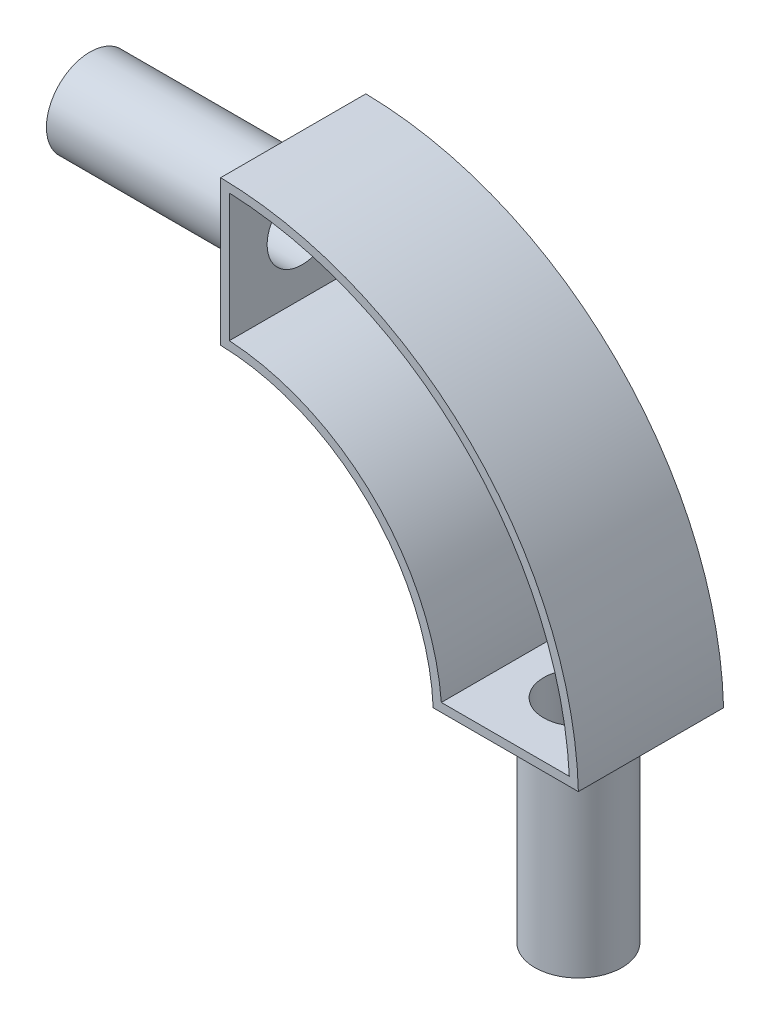
ISO-10303-21;
HEADER;
FILE_DESCRIPTION(('STEP AP214'),'2;1');
FILE_NAME('part.step','',(''),(''),'','','');
FILE_SCHEMA(('AUTOMOTIVE_DESIGN { 1 0 10303 214 1 1 1 1 }'));
ENDSEC;
DATA;
#1=APPLICATION_CONTEXT('core data for automotive mechanical design processes');
#2=APPLICATION_PROTOCOL_DEFINITION('international standard','automotive_design',2000,#1);
#3=PRODUCT_CONTEXT('',#1,'mechanical');
#4=PRODUCT('Part','Part','',(#3));
#5=PRODUCT_RELATED_PRODUCT_CATEGORY('part','',(#4));
#6=PRODUCT_DEFINITION_FORMATION('','',#4);
#7=PRODUCT_DEFINITION_CONTEXT('part definition',#1,'design');
#8=PRODUCT_DEFINITION('design','',#6,#7);
#9=PRODUCT_DEFINITION_SHAPE('','',#8);
#10=(LENGTH_UNIT() NAMED_UNIT(*) SI_UNIT(.MILLI.,.METRE.));
#11=(NAMED_UNIT(*) PLANE_ANGLE_UNIT() SI_UNIT($,.RADIAN.));
#12=(NAMED_UNIT(*) SI_UNIT($,.STERADIAN.) SOLID_ANGLE_UNIT());
#13=UNCERTAINTY_MEASURE_WITH_UNIT(LENGTH_MEASURE(1.E-05),#10,'distance_accuracy_value','');
#14=(GEOMETRIC_REPRESENTATION_CONTEXT(3) GLOBAL_UNCERTAINTY_ASSIGNED_CONTEXT((#13)) GLOBAL_UNIT_ASSIGNED_CONTEXT((#10,
#11,#12)) REPRESENTATION_CONTEXT('',''));
#15=CARTESIAN_POINT('',(0.,0.,0.));
#16=DIRECTION('',(0.,0.,1.));
#17=DIRECTION('',(1.,0.,0.));
#18=AXIS2_PLACEMENT_3D('',#15,#16,#17);
#19=CARTESIAN_POINT('',(-1.75878568718482,-3.47514572884304,25.));
#20=DIRECTION('',(0.,0.,-1.));
#21=DIRECTION('',(-1.,0.,0.));
#22=AXIS2_PLACEMENT_3D('',#19,#20,#21);
#23=PLANE('',#22);
#24=CARTESIAN_POINT('',(-1.75878568718482,-3.47514572884304,25.));
#25=DIRECTION('',(0.,0.,1.));
#26=DIRECTION('',(-1.,0.,0.));
#27=AXIS2_PLACEMENT_3D('',#24,#25,#26);
#28=CIRCLE('',#27,125.);
#29=CARTESIAN_POINT('',(123.192898423768,0.,25.));
#30=VERTEX_POINT('',#29);
#31=CARTESIAN_POINT('',(0.,121.512480350328,25.));
#32=VERTEX_POINT('',#31);
#33=EDGE_CURVE('E142',#30,#32,#28,.T.);
#34=ORIENTED_EDGE('',*,*,#33,.T.);
#35=DIRECTION('',(0.,-1.,0.));
#36=VECTOR('',#35,1.);
#37=CARTESIAN_POINT('',(0.,71.5124803503275,25.));
#38=LINE('',#37,#36);
#39=CARTESIAN_POINT('',(0.,71.5124803503275,25.));
#40=VERTEX_POINT('',#39);
#41=EDGE_CURVE('E86',#32,#40,#38,.T.);
#42=ORIENTED_EDGE('',*,*,#41,.T.);
#43=CARTESIAN_POINT('',(-1.72689536458121,-3.46763589658015,25.));
#44=DIRECTION('',(0.,0.,-1.));
#45=DIRECTION('',(-1.,0.,0.));
#46=AXIS2_PLACEMENT_3D('',#43,#44,#45);
#47=CIRCLE('',#46,75.);
#48=CARTESIAN_POINT('',(73.1928984237679,0.,25.));
#49=VERTEX_POINT('',#48);
#50=EDGE_CURVE('E145',#40,#49,#47,.T.);
#51=ORIENTED_EDGE('',*,*,#50,.T.);
#52=DIRECTION('',(1.,0.,0.));
#53=VECTOR('',#52,1.);
#54=CARTESIAN_POINT('',(73.1928984237679,0.,25.));
#55=LINE('',#54,#53);
#56=EDGE_CURVE('E57',#49,#30,#55,.T.);
#57=ORIENTED_EDGE('',*,*,#56,.T.);
#58=EDGE_LOOP('',(#34,#42,#51,#57));
#59=FACE_BOUND('',#58,.T.);
#60=CARTESIAN_POINT('',(-1.75878568718482,-3.47514572884304,25.));
#61=DIRECTION('',(0.,0.,-1.));
#62=DIRECTION('',(-1.,0.,0.));
#63=AXIS2_PLACEMENT_3D('',#60,#61,#62);
#64=CIRCLE('',#63,122.);
#65=CARTESIAN_POINT('',(120.069259063563,3.,25.));
#66=VERTEX_POINT('',#65);
#67=CARTESIAN_POINT('',(3.00000000000001,118.43200729666,25.));
#68=VERTEX_POINT('',#67);
#69=EDGE_CURVE('E131',#66,#68,#64,.F.);
#70=ORIENTED_EDGE('',*,*,#69,.F.);
#71=DIRECTION('',(1.,0.,0.));
#72=VECTOR('',#71,1.);
#73=CARTESIAN_POINT('',(-1.75878568718482,3.,25.));
#74=LINE('',#73,#72);
#75=CARTESIAN_POINT('',(76.0044991032223,3.,25.));
#76=VERTEX_POINT('',#75);
#77=EDGE_CURVE('E140',#76,#66,#74,.T.);
#78=ORIENTED_EDGE('',*,*,#77,.F.);
#79=CARTESIAN_POINT('',(-1.72689536458121,-3.46763589658015,25.));
#80=DIRECTION('',(0.,0.,-1.));
#81=DIRECTION('',(-1.,0.,0.));
#82=AXIS2_PLACEMENT_3D('',#79,#80,#81);
#83=CIRCLE('',#82,78.);
#84=CARTESIAN_POINT('',(3.,74.3890045409079,25.));
#85=VERTEX_POINT('',#84);
#86=EDGE_CURVE('E138',#85,#76,#83,.T.);
#87=ORIENTED_EDGE('',*,*,#86,.F.);
#88=DIRECTION('',(0.,-1.,0.));
#89=VECTOR('',#88,1.);
#90=CARTESIAN_POINT('',(2.99999999999999,-3.47514572884304,25.));
#91=LINE('',#90,#89);
#92=EDGE_CURVE('E123',#68,#85,#91,.T.);
#93=ORIENTED_EDGE('',*,*,#92,.F.);
#94=EDGE_LOOP('',(#70,#78,#87,#93));
#95=FACE_BOUND('',#94,.T.);
#96=ADVANCED_FACE('F33',(#59,#95),#23,.F.);
#97=CARTESIAN_POINT('',(-1.75878568718482,-3.47514572884304,25.));
#98=DIRECTION('',(0.,0.,-1.));
#99=DIRECTION('',(-1.,0.,0.));
#100=AXIS2_PLACEMENT_3D('',#97,#98,#99);
#101=CYLINDRICAL_SURFACE('',#100,125.);
#102=CARTESIAN_POINT('',(-1.75878568718482,-3.47514572884304,-25.));
#103=DIRECTION('',(0.,0.,1.));
#104=DIRECTION('',(-1.,0.,0.));
#105=AXIS2_PLACEMENT_3D('',#102,#103,#104);
#106=CIRCLE('',#105,125.);
#107=CARTESIAN_POINT('',(123.192898423768,0.,-25.));
#108=VERTEX_POINT('',#107);
#109=CARTESIAN_POINT('',(0.,121.512480350328,-25.));
#110=VERTEX_POINT('',#109);
#111=EDGE_CURVE('E149',#108,#110,#106,.T.);
#112=ORIENTED_EDGE('',*,*,#111,.T.);
#113=DIRECTION('',(0.,0.,-1.));
#114=VECTOR('',#113,1.);
#115=CARTESIAN_POINT('',(0.,121.512480350328,25.));
#116=LINE('',#115,#114);
#117=EDGE_CURVE('E163',#32,#110,#116,.T.);
#118=ORIENTED_EDGE('',*,*,#117,.F.);
#119=ORIENTED_EDGE('',*,*,#33,.F.);
#120=DIRECTION('',(0.,0.,-1.));
#121=VECTOR('',#120,1.);
#122=CARTESIAN_POINT('',(123.192898423768,0.,25.));
#123=LINE('',#122,#121);
#124=EDGE_CURVE('E148',#30,#108,#123,.T.);
#125=ORIENTED_EDGE('',*,*,#124,.T.);
#126=EDGE_LOOP('',(#112,#118,#119,#125));
#127=FACE_BOUND('',#126,.T.);
#128=ADVANCED_FACE('F35',(#127),#101,.T.);
#129=CARTESIAN_POINT('',(0.,71.5124803503275,25.));
#130=DIRECTION('',(1.,0.,0.));
#131=DIRECTION('',(0.,1.,0.));
#132=AXIS2_PLACEMENT_3D('',#129,#130,#131);
#133=PLANE('',#132);
#134=CARTESIAN_POINT('',(0.,96.5124803503275,0.));
#135=DIRECTION('',(1.,0.,0.));
#136=DIRECTION('',(0.,1.,0.));
#137=AXIS2_PLACEMENT_3D('',#134,#135,#136);
#138=CIRCLE('',#137,15.);
#139=CARTESIAN_POINT('',(0.,111.512480350328,0.));
#140=VERTEX_POINT('',#139);
#141=EDGE_CURVE('E41',#140,#140,#138,.F.);
#142=ORIENTED_EDGE('',*,*,#141,.F.);
#143=EDGE_LOOP('',(#142));
#144=FACE_BOUND('',#143,.T.);
#145=DIRECTION('',(0.,-1.,0.));
#146=VECTOR('',#145,1.);
#147=CARTESIAN_POINT('',(0.,71.5124803503275,-25.));
#148=LINE('',#147,#146);
#149=CARTESIAN_POINT('',(0.,71.5124803503275,-25.));
#150=VERTEX_POINT('',#149);
#151=EDGE_CURVE('E152',#110,#150,#148,.T.);
#152=ORIENTED_EDGE('',*,*,#151,.T.);
#153=DIRECTION('',(0.,0.,-1.));
#154=VECTOR('',#153,1.);
#155=CARTESIAN_POINT('',(0.,71.5124803503275,25.));
#156=LINE('',#155,#154);
#157=EDGE_CURVE('E160',#40,#150,#156,.T.);
#158=ORIENTED_EDGE('',*,*,#157,.F.);
#159=ORIENTED_EDGE('',*,*,#41,.F.);
#160=ORIENTED_EDGE('',*,*,#117,.T.);
#161=EDGE_LOOP('',(#152,#158,#159,#160));
#162=FACE_BOUND('',#161,.T.);
#163=ADVANCED_FACE('F169',(#144,#162),#133,.F.);
#164=CARTESIAN_POINT('',(-1.72689536458121,-3.46763589658015,25.));
#165=DIRECTION('',(0.,0.,-1.));
#166=DIRECTION('',(-1.,0.,0.));
#167=AXIS2_PLACEMENT_3D('',#164,#165,#166);
#168=CYLINDRICAL_SURFACE('',#167,75.);
#169=CARTESIAN_POINT('',(-1.72689536458121,-3.46763589658015,-25.));
#170=DIRECTION('',(0.,0.,-1.));
#171=DIRECTION('',(-1.,0.,0.));
#172=AXIS2_PLACEMENT_3D('',#169,#170,#171);
#173=CIRCLE('',#172,75.);
#174=CARTESIAN_POINT('',(73.1928984237679,0.,-25.));
#175=VERTEX_POINT('',#174);
#176=EDGE_CURVE('E154',#150,#175,#173,.T.);
#177=ORIENTED_EDGE('',*,*,#176,.T.);
#178=DIRECTION('',(0.,0.,-1.));
#179=VECTOR('',#178,1.);
#180=CARTESIAN_POINT('',(73.1928984237679,0.,25.));
#181=LINE('',#180,#179);
#182=EDGE_CURVE('E158',#49,#175,#181,.T.);
#183=ORIENTED_EDGE('',*,*,#182,.F.);
#184=ORIENTED_EDGE('',*,*,#50,.F.);
#185=ORIENTED_EDGE('',*,*,#157,.T.);
#186=EDGE_LOOP('',(#177,#183,#184,#185));
#187=FACE_BOUND('',#186,.T.);
#188=ADVANCED_FACE('F171',(#187),#168,.F.);
#189=CARTESIAN_POINT('',(73.1928984237679,0.,25.));
#190=DIRECTION('',(0.,1.,0.));
#191=DIRECTION('',(0.,0.,1.));
#192=AXIS2_PLACEMENT_3D('',#189,#190,#191);
#193=PLANE('',#192);
#194=CARTESIAN_POINT('',(98.1928984237679,0.,0.));
#195=DIRECTION('',(0.,1.,0.));
#196=DIRECTION('',(0.,0.,1.));
#197=AXIS2_PLACEMENT_3D('',#194,#195,#196);
#198=CIRCLE('',#197,15.);
#199=CARTESIAN_POINT('',(98.1928984237679,0.,15.));
#200=VERTEX_POINT('',#199);
#201=EDGE_CURVE('E11',#200,#200,#198,.F.);
#202=ORIENTED_EDGE('',*,*,#201,.F.);
#203=EDGE_LOOP('',(#202));
#204=FACE_BOUND('',#203,.T.);
#205=DIRECTION('',(1.,0.,0.));
#206=VECTOR('',#205,1.);
#207=CARTESIAN_POINT('',(73.1928984237679,0.,-25.));
#208=LINE('',#207,#206);
#209=EDGE_CURVE('E78',#175,#108,#208,.T.);
#210=ORIENTED_EDGE('',*,*,#209,.T.);
#211=ORIENTED_EDGE('',*,*,#124,.F.);
#212=ORIENTED_EDGE('',*,*,#56,.F.);
#213=ORIENTED_EDGE('',*,*,#182,.T.);
#214=EDGE_LOOP('',(#210,#211,#212,#213));
#215=FACE_BOUND('',#214,.T.);
#216=ADVANCED_FACE('F182',(#204,#215),#193,.F.);
#217=CARTESIAN_POINT('',(-1.75878568718482,-3.47514572884304,-25.));
#218=DIRECTION('',(0.,0.,-1.));
#219=DIRECTION('',(-1.,0.,0.));
#220=AXIS2_PLACEMENT_3D('',#217,#218,#219);
#221=PLANE('',#220);
#222=ORIENTED_EDGE('',*,*,#111,.F.);
#223=ORIENTED_EDGE('',*,*,#209,.F.);
#224=ORIENTED_EDGE('',*,*,#176,.F.);
#225=ORIENTED_EDGE('',*,*,#151,.F.);
#226=EDGE_LOOP('',(#222,#223,#224,#225));
#227=FACE_BOUND('',#226,.T.);
#228=ADVANCED_FACE('F179',(#227),#221,.T.);
#229=CARTESIAN_POINT('',(-1.75878568718482,-3.47514572884304,25.));
#230=DIRECTION('',(0.,0.,-1.));
#231=DIRECTION('',(-1.,0.,0.));
#232=AXIS2_PLACEMENT_3D('',#229,#230,#231);
#233=CYLINDRICAL_SURFACE('',#232,122.);
#234=CARTESIAN_POINT('',(-1.75878568718482,-3.47514572884304,-22.));
#235=DIRECTION('',(0.,0.,-1.));
#236=DIRECTION('',(-1.,0.,0.));
#237=AXIS2_PLACEMENT_3D('',#234,#235,#236);
#238=CIRCLE('',#237,122.);
#239=CARTESIAN_POINT('',(120.069259063563,3.,-22.));
#240=VERTEX_POINT('',#239);
#241=CARTESIAN_POINT('',(3.00000000000001,118.43200729666,-22.));
#242=VERTEX_POINT('',#241);
#243=EDGE_CURVE('E114',#240,#242,#238,.F.);
#244=ORIENTED_EDGE('',*,*,#243,.F.);
#245=DIRECTION('',(0.,0.,-1.));
#246=VECTOR('',#245,1.);
#247=CARTESIAN_POINT('',(120.069259063563,3.,25.));
#248=LINE('',#247,#246);
#249=EDGE_CURVE('E134',#66,#240,#248,.T.);
#250=ORIENTED_EDGE('',*,*,#249,.F.);
#251=ORIENTED_EDGE('',*,*,#69,.T.);
#252=DIRECTION('',(0.,0.,-1.));
#253=VECTOR('',#252,1.);
#254=CARTESIAN_POINT('',(3.00000000000001,118.43200729666,25.));
#255=LINE('',#254,#253);
#256=EDGE_CURVE('E126',#68,#242,#255,.T.);
#257=ORIENTED_EDGE('',*,*,#256,.T.);
#258=EDGE_LOOP('',(#244,#250,#251,#257));
#259=FACE_BOUND('',#258,.T.);
#260=ADVANCED_FACE('F190',(#259),#233,.F.);
#261=CARTESIAN_POINT('',(3.,71.5124803503275,25.));
#262=DIRECTION('',(1.,0.,0.));
#263=DIRECTION('',(0.,1.,0.));
#264=AXIS2_PLACEMENT_3D('',#261,#262,#263);
#265=PLANE('',#264);
#266=CARTESIAN_POINT('',(3.00000000000001,96.5124803503275,0.));
#267=DIRECTION('',(1.,0.,0.));
#268=DIRECTION('',(0.,1.,0.));
#269=AXIS2_PLACEMENT_3D('',#266,#267,#268);
#270=CIRCLE('',#269,12.);
#271=CARTESIAN_POINT('',(3.00000000000001,108.512480350328,0.));
#272=VERTEX_POINT('',#271);
#273=EDGE_CURVE('E255',#272,#272,#270,.T.);
#274=ORIENTED_EDGE('',*,*,#273,.F.);
#275=EDGE_LOOP('',(#274));
#276=FACE_BOUND('',#275,.T.);
#277=DIRECTION('',(0.,-1.,0.));
#278=VECTOR('',#277,1.);
#279=CARTESIAN_POINT('',(2.99999999999999,-3.47514572884304,-22.));
#280=LINE('',#279,#278);
#281=CARTESIAN_POINT('',(3.,74.3890045409079,-22.));
#282=VERTEX_POINT('',#281);
#283=EDGE_CURVE('E108',#242,#282,#280,.T.);
#284=ORIENTED_EDGE('',*,*,#283,.F.);
#285=ORIENTED_EDGE('',*,*,#256,.F.);
#286=ORIENTED_EDGE('',*,*,#92,.T.);
#287=DIRECTION('',(0.,0.,-1.));
#288=VECTOR('',#287,1.);
#289=CARTESIAN_POINT('',(3.,74.3890045409079,25.));
#290=LINE('',#289,#288);
#291=EDGE_CURVE('E120',#85,#282,#290,.T.);
#292=ORIENTED_EDGE('',*,*,#291,.T.);
#293=EDGE_LOOP('',(#284,#285,#286,#292));
#294=FACE_BOUND('',#293,.T.);
#295=ADVANCED_FACE('F121',(#276,#294),#265,.T.);
#296=CARTESIAN_POINT('',(-1.72689536458121,-3.46763589658015,25.));
#297=DIRECTION('',(0.,0.,-1.));
#298=DIRECTION('',(-1.,0.,0.));
#299=AXIS2_PLACEMENT_3D('',#296,#297,#298);
#300=CYLINDRICAL_SURFACE('',#299,78.);
#301=CARTESIAN_POINT('',(-1.72689536458121,-3.46763589658015,-22.));
#302=DIRECTION('',(0.,0.,-1.));
#303=DIRECTION('',(-1.,0.,0.));
#304=AXIS2_PLACEMENT_3D('',#301,#302,#303);
#305=CIRCLE('',#304,78.);
#306=CARTESIAN_POINT('',(76.0044991032223,3.,-22.));
#307=VERTEX_POINT('',#306);
#308=EDGE_CURVE('E112',#282,#307,#305,.T.);
#309=ORIENTED_EDGE('',*,*,#308,.F.);
#310=ORIENTED_EDGE('',*,*,#291,.F.);
#311=ORIENTED_EDGE('',*,*,#86,.T.);
#312=DIRECTION('',(0.,0.,-1.));
#313=VECTOR('',#312,1.);
#314=CARTESIAN_POINT('',(76.0044991032223,3.,25.));
#315=LINE('',#314,#313);
#316=EDGE_CURVE('E48',#76,#307,#315,.T.);
#317=ORIENTED_EDGE('',*,*,#316,.T.);
#318=EDGE_LOOP('',(#309,#310,#311,#317));
#319=FACE_BOUND('',#318,.T.);
#320=ADVANCED_FACE('F128',(#319),#300,.T.);
#321=CARTESIAN_POINT('',(73.1928984237679,3.,25.));
#322=DIRECTION('',(0.,1.,0.));
#323=DIRECTION('',(0.,0.,1.));
#324=AXIS2_PLACEMENT_3D('',#321,#322,#323);
#325=PLANE('',#324);
#326=CARTESIAN_POINT('',(98.1928984237679,3.,0.));
#327=DIRECTION('',(0.,1.,0.));
#328=DIRECTION('',(0.,0.,1.));
#329=AXIS2_PLACEMENT_3D('',#326,#327,#328);
#330=CIRCLE('',#329,12.);
#331=CARTESIAN_POINT('',(98.1928984237679,3.,12.));
#332=VERTEX_POINT('',#331);
#333=EDGE_CURVE('E242',#332,#332,#330,.T.);
#334=ORIENTED_EDGE('',*,*,#333,.F.);
#335=EDGE_LOOP('',(#334));
#336=FACE_BOUND('',#335,.T.);
#337=DIRECTION('',(1.,0.,0.));
#338=VECTOR('',#337,1.);
#339=CARTESIAN_POINT('',(-1.75878568718482,3.,-22.));
#340=LINE('',#339,#338);
#341=EDGE_CURVE('E129',#307,#240,#340,.T.);
#342=ORIENTED_EDGE('',*,*,#341,.F.);
#343=ORIENTED_EDGE('',*,*,#316,.F.);
#344=ORIENTED_EDGE('',*,*,#77,.T.);
#345=ORIENTED_EDGE('',*,*,#249,.T.);
#346=EDGE_LOOP('',(#342,#343,#344,#345));
#347=FACE_BOUND('',#346,.T.);
#348=ADVANCED_FACE('F203',(#336,#347),#325,.T.);
#349=CARTESIAN_POINT('',(-1.75878568718482,-3.47514572884304,-22.));
#350=DIRECTION('',(0.,0.,-1.));
#351=DIRECTION('',(-1.,0.,0.));
#352=AXIS2_PLACEMENT_3D('',#349,#350,#351);
#353=PLANE('',#352);
#354=ORIENTED_EDGE('',*,*,#243,.T.);
#355=ORIENTED_EDGE('',*,*,#283,.T.);
#356=ORIENTED_EDGE('',*,*,#308,.T.);
#357=ORIENTED_EDGE('',*,*,#341,.T.);
#358=EDGE_LOOP('',(#354,#355,#356,#357));
#359=FACE_BOUND('',#358,.T.);
#360=ADVANCED_FACE('F110',(#359),#353,.F.);
#361=CARTESIAN_POINT('',(-70.,96.5124803503275,0.));
#362=DIRECTION('',(1.,0.,0.));
#363=DIRECTION('',(0.,1.,0.));
#364=AXIS2_PLACEMENT_3D('',#361,#362,#363);
#365=CYLINDRICAL_SURFACE('',#364,15.);
#366=CARTESIAN_POINT('',(-70.,96.5124803503275,0.));
#367=DIRECTION('',(-1.,0.,0.));
#368=DIRECTION('',(0.,-1.,0.));
#369=AXIS2_PLACEMENT_3D('',#366,#367,#368);
#370=CIRCLE('',#369,15.);
#371=CARTESIAN_POINT('',(-70.,81.5124803503275,0.));
#372=VERTEX_POINT('',#371);
#373=EDGE_CURVE('E258',#372,#372,#370,.T.);
#374=ORIENTED_EDGE('',*,*,#373,.F.);
#375=EDGE_LOOP('',(#374));
#376=FACE_BOUND('',#375,.T.);
#377=ORIENTED_EDGE('',*,*,#141,.T.);
#378=EDGE_LOOP('',(#377));
#379=FACE_BOUND('',#378,.T.);
#380=ADVANCED_FACE('F167',(#376,#379),#365,.T.);
#381=CARTESIAN_POINT('',(-70.,96.5124803503275,0.));
#382=DIRECTION('',(-1.,0.,0.));
#383=DIRECTION('',(0.,-1.,0.));
#384=AXIS2_PLACEMENT_3D('',#381,#382,#383);
#385=PLANE('',#384);
#386=CARTESIAN_POINT('',(-70.,96.5124803503275,0.));
#387=DIRECTION('',(-1.,0.,0.));
#388=DIRECTION('',(0.,-1.,0.));
#389=AXIS2_PLACEMENT_3D('',#386,#387,#388);
#390=CIRCLE('',#389,12.);
#391=CARTESIAN_POINT('',(-70.,84.5124803503276,0.));
#392=VERTEX_POINT('',#391);
#393=EDGE_CURVE('E252',#392,#392,#390,.T.);
#394=ORIENTED_EDGE('',*,*,#393,.F.);
#395=EDGE_LOOP('',(#394));
#396=FACE_BOUND('',#395,.T.);
#397=ORIENTED_EDGE('',*,*,#373,.T.);
#398=EDGE_LOOP('',(#397));
#399=FACE_BOUND('',#398,.T.);
#400=ADVANCED_FACE('F217',(#396,#399),#385,.T.);
#401=CARTESIAN_POINT('',(5.,96.5124803503275,0.));
#402=DIRECTION('',(-1.,0.,0.));
#403=DIRECTION('',(0.,-1.,0.));
#404=AXIS2_PLACEMENT_3D('',#401,#402,#403);
#405=CYLINDRICAL_SURFACE('',#404,12.);
#406=ORIENTED_EDGE('',*,*,#273,.T.);
#407=EDGE_LOOP('',(#406));
#408=FACE_BOUND('',#407,.T.);
#409=ORIENTED_EDGE('',*,*,#393,.T.);
#410=EDGE_LOOP('',(#409));
#411=FACE_BOUND('',#410,.T.);
#412=ADVANCED_FACE('F221',(#408,#411),#405,.F.);
#413=CARTESIAN_POINT('',(98.1928984237679,-70.,0.));
#414=DIRECTION('',(0.,1.,0.));
#415=DIRECTION('',(0.,0.,1.));
#416=AXIS2_PLACEMENT_3D('',#413,#414,#415);
#417=CYLINDRICAL_SURFACE('',#416,15.);
#418=CARTESIAN_POINT('',(98.1928984237679,-70.,0.));
#419=DIRECTION('',(0.,-1.,0.));
#420=DIRECTION('',(0.,0.,-1.));
#421=AXIS2_PLACEMENT_3D('',#418,#419,#420);
#422=CIRCLE('',#421,15.);
#423=CARTESIAN_POINT('',(98.1928984237679,-70.,-15.));
#424=VERTEX_POINT('',#423);
#425=EDGE_CURVE('E247',#424,#424,#422,.T.);
#426=ORIENTED_EDGE('',*,*,#425,.F.);
#427=EDGE_LOOP('',(#426));
#428=FACE_BOUND('',#427,.T.);
#429=ORIENTED_EDGE('',*,*,#201,.T.);
#430=EDGE_LOOP('',(#429));
#431=FACE_BOUND('',#430,.T.);
#432=ADVANCED_FACE('F225',(#428,#431),#417,.T.);
#433=CARTESIAN_POINT('',(98.1928984237679,-70.,0.));
#434=DIRECTION('',(0.,-1.,0.));
#435=DIRECTION('',(0.,0.,-1.));
#436=AXIS2_PLACEMENT_3D('',#433,#434,#435);
#437=PLANE('',#436);
#438=CARTESIAN_POINT('',(98.1928984237679,-70.,0.));
#439=DIRECTION('',(0.,-1.,0.));
#440=DIRECTION('',(0.,0.,-1.));
#441=AXIS2_PLACEMENT_3D('',#438,#439,#440);
#442=CIRCLE('',#441,12.);
#443=CARTESIAN_POINT('',(98.1928984237679,-70.,-12.));
#444=VERTEX_POINT('',#443);
#445=EDGE_CURVE('E245',#444,#444,#442,.T.);
#446=ORIENTED_EDGE('',*,*,#445,.F.);
#447=EDGE_LOOP('',(#446));
#448=FACE_BOUND('',#447,.T.);
#449=ORIENTED_EDGE('',*,*,#425,.T.);
#450=EDGE_LOOP('',(#449));
#451=FACE_BOUND('',#450,.T.);
#452=ADVANCED_FACE('F229',(#448,#451),#437,.T.);
#453=CARTESIAN_POINT('',(98.1928984237679,4.99999999999999,0.));
#454=DIRECTION('',(0.,-1.,0.));
#455=DIRECTION('',(0.,0.,-1.));
#456=AXIS2_PLACEMENT_3D('',#453,#454,#455);
#457=CYLINDRICAL_SURFACE('',#456,12.);
#458=ORIENTED_EDGE('',*,*,#333,.T.);
#459=EDGE_LOOP('',(#458));
#460=FACE_BOUND('',#459,.T.);
#461=ORIENTED_EDGE('',*,*,#445,.T.);
#462=EDGE_LOOP('',(#461));
#463=FACE_BOUND('',#462,.T.);
#464=ADVANCED_FACE('F233',(#460,#463),#457,.F.);
#465=CLOSED_SHELL('',(#96,#128,#163,#188,#216,#228,#260,#295,#320,#348,#360,#380,#400,#412,#432,
#452,#464));
#466=MANIFOLD_SOLID_BREP('B2',#465);
#467=ADVANCED_BREP_SHAPE_REPRESENTATION('',(#18,#466),#14);
#468=SHAPE_DEFINITION_REPRESENTATION(#9,#467);
ENDSEC;
END-ISO-10303-21;
